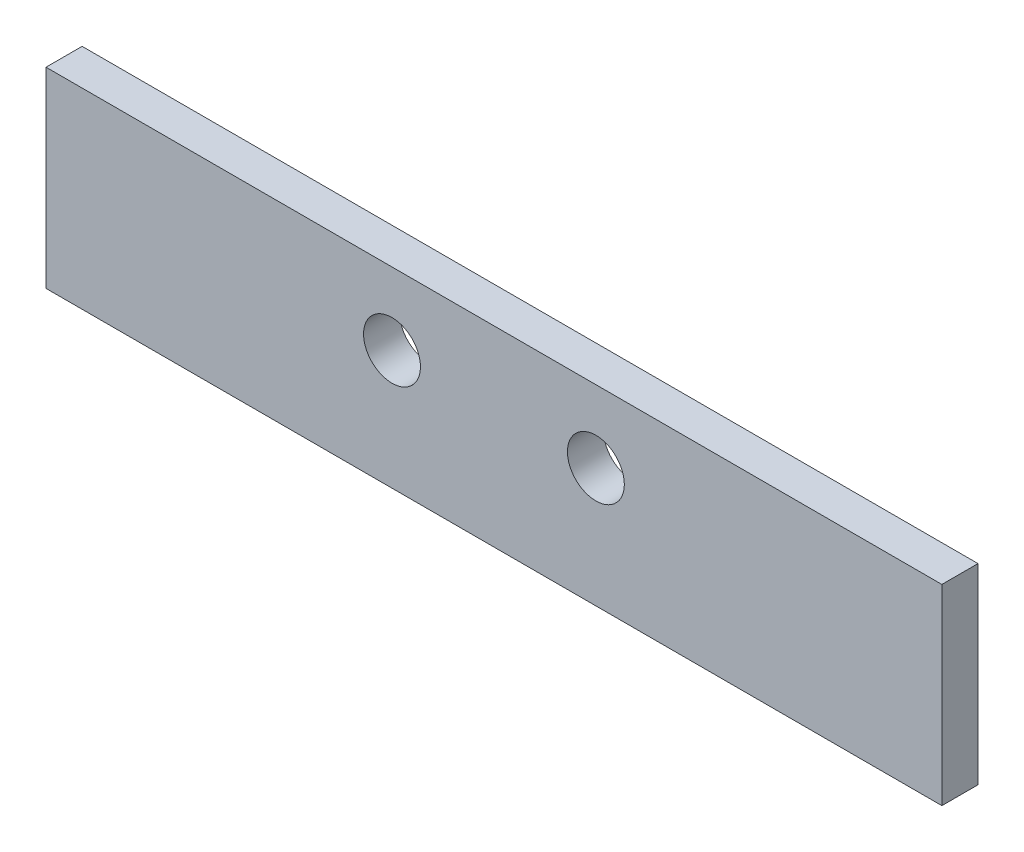
ISO-10303-21;
HEADER;
FILE_DESCRIPTION(('STEP AP214'),'2;1');
FILE_NAME('part.step','',(''),(''),'','','');
FILE_SCHEMA(('AUTOMOTIVE_DESIGN { 1 0 10303 214 1 1 1 1 }'));
ENDSEC;
DATA;
#1=APPLICATION_CONTEXT('core data for automotive mechanical design processes');
#2=APPLICATION_PROTOCOL_DEFINITION('international standard','automotive_design',2000,#1);
#3=PRODUCT_CONTEXT('',#1,'mechanical');
#4=PRODUCT('Part','Part','',(#3));
#5=PRODUCT_RELATED_PRODUCT_CATEGORY('part','',(#4));
#6=PRODUCT_DEFINITION_FORMATION('','',#4);
#7=PRODUCT_DEFINITION_CONTEXT('part definition',#1,'design');
#8=PRODUCT_DEFINITION('design','',#6,#7);
#9=PRODUCT_DEFINITION_SHAPE('','',#8);
#10=(LENGTH_UNIT() NAMED_UNIT(*) SI_UNIT(.MILLI.,.METRE.));
#11=(NAMED_UNIT(*) PLANE_ANGLE_UNIT() SI_UNIT($,.RADIAN.));
#12=(NAMED_UNIT(*) SI_UNIT($,.STERADIAN.) SOLID_ANGLE_UNIT());
#13=UNCERTAINTY_MEASURE_WITH_UNIT(LENGTH_MEASURE(1.E-05),#10,'distance_accuracy_value','');
#14=(GEOMETRIC_REPRESENTATION_CONTEXT(3) GLOBAL_UNCERTAINTY_ASSIGNED_CONTEXT((#13)) GLOBAL_UNIT_ASSIGNED_CONTEXT((#10,
#11,#12)) REPRESENTATION_CONTEXT('',''));
#15=CARTESIAN_POINT('',(0.,0.,0.));
#16=DIRECTION('',(0.,0.,1.));
#17=DIRECTION('',(1.,0.,0.));
#18=AXIS2_PLACEMENT_3D('',#15,#16,#17);
#19=CARTESIAN_POINT('',(39.37,-8.4201,3.175));
#20=DIRECTION('',(-1.,0.,0.));
#21=DIRECTION('',(0.,0.,1.));
#22=AXIS2_PLACEMENT_3D('',#19,#20,#21);
#23=PLANE('',#22);
#24=DIRECTION('',(0.,1.,0.));
#25=VECTOR('',#24,1.);
#26=CARTESIAN_POINT('',(39.37,-8.4201,0.));
#27=LINE('',#26,#25);
#28=CARTESIAN_POINT('',(39.37,-8.4201,0.));
#29=VERTEX_POINT('',#28);
#30=CARTESIAN_POINT('',(39.37,8.4201,0.));
#31=VERTEX_POINT('',#30);
#32=EDGE_CURVE('E104',#29,#31,#27,.T.);
#33=ORIENTED_EDGE('',*,*,#32,.T.);
#34=DIRECTION('',(0.,0.,-1.));
#35=VECTOR('',#34,1.);
#36=CARTESIAN_POINT('',(39.37,8.4201,3.175));
#37=LINE('',#36,#35);
#38=CARTESIAN_POINT('',(39.37,8.4201,3.175));
#39=VERTEX_POINT('',#38);
#40=EDGE_CURVE('E11',#39,#31,#37,.T.);
#41=ORIENTED_EDGE('',*,*,#40,.F.);
#42=DIRECTION('',(0.,1.,0.));
#43=VECTOR('',#42,1.);
#44=CARTESIAN_POINT('',(39.37,-8.4201,3.175));
#45=LINE('',#44,#43);
#46=CARTESIAN_POINT('',(39.37,-8.4201,3.175));
#47=VERTEX_POINT('',#46);
#48=EDGE_CURVE('E92',#47,#39,#45,.T.);
#49=ORIENTED_EDGE('',*,*,#48,.F.);
#50=DIRECTION('',(0.,0.,-1.));
#51=VECTOR('',#50,1.);
#52=CARTESIAN_POINT('',(39.37,-8.4201,3.175));
#53=LINE('',#52,#51);
#54=EDGE_CURVE('E100',#47,#29,#53,.T.);
#55=ORIENTED_EDGE('',*,*,#54,.T.);
#56=EDGE_LOOP('',(#33,#41,#49,#55));
#57=FACE_BOUND('',#56,.T.);
#58=ADVANCED_FACE('F41',(#57),#23,.F.);
#59=CARTESIAN_POINT('',(-39.37,8.4201,3.175));
#60=DIRECTION('',(0.,-1.,0.));
#61=DIRECTION('',(0.,0.,-1.));
#62=AXIS2_PLACEMENT_3D('',#59,#60,#61);
#63=PLANE('',#62);
#64=DIRECTION('',(-1.,0.,0.));
#65=VECTOR('',#64,1.);
#66=CARTESIAN_POINT('',(-39.37,8.4201,0.));
#67=LINE('',#66,#65);
#68=CARTESIAN_POINT('',(-39.37,8.4201,0.));
#69=VERTEX_POINT('',#68);
#70=EDGE_CURVE('E96',#31,#69,#67,.T.);
#71=ORIENTED_EDGE('',*,*,#70,.T.);
#72=DIRECTION('',(0.,0.,-1.));
#73=VECTOR('',#72,1.);
#74=CARTESIAN_POINT('',(-39.37,8.4201,3.175));
#75=LINE('',#74,#73);
#76=CARTESIAN_POINT('',(-39.37,8.4201,3.175));
#77=VERTEX_POINT('',#76);
#78=EDGE_CURVE('E49',#77,#69,#75,.T.);
#79=ORIENTED_EDGE('',*,*,#78,.F.);
#80=DIRECTION('',(-1.,0.,0.));
#81=VECTOR('',#80,1.);
#82=CARTESIAN_POINT('',(-39.37,8.4201,3.175));
#83=LINE('',#82,#81);
#84=EDGE_CURVE('E87',#39,#77,#83,.T.);
#85=ORIENTED_EDGE('',*,*,#84,.F.);
#86=ORIENTED_EDGE('',*,*,#40,.T.);
#87=EDGE_LOOP('',(#71,#79,#85,#86));
#88=FACE_BOUND('',#87,.T.);
#89=ADVANCED_FACE('F95',(#88),#63,.F.);
#90=CARTESIAN_POINT('',(-39.37,-8.4201,3.175));
#91=DIRECTION('',(1.,0.,0.));
#92=DIRECTION('',(0.,0.,-1.));
#93=AXIS2_PLACEMENT_3D('',#90,#91,#92);
#94=PLANE('',#93);
#95=DIRECTION('',(0.,-1.,0.));
#96=VECTOR('',#95,1.);
#97=CARTESIAN_POINT('',(-39.37,-8.4201,0.));
#98=LINE('',#97,#96);
#99=CARTESIAN_POINT('',(-39.37,-8.4201,0.));
#100=VERTEX_POINT('',#99);
#101=EDGE_CURVE('E74',#69,#100,#98,.T.);
#102=ORIENTED_EDGE('',*,*,#101,.T.);
#103=DIRECTION('',(0.,0.,-1.));
#104=VECTOR('',#103,1.);
#105=CARTESIAN_POINT('',(-39.37,-8.4201,3.175));
#106=LINE('',#105,#104);
#107=CARTESIAN_POINT('',(-39.37,-8.4201,3.175));
#108=VERTEX_POINT('',#107);
#109=EDGE_CURVE('E97',#108,#100,#106,.T.);
#110=ORIENTED_EDGE('',*,*,#109,.F.);
#111=DIRECTION('',(0.,-1.,0.));
#112=VECTOR('',#111,1.);
#113=CARTESIAN_POINT('',(-39.37,-8.4201,3.175));
#114=LINE('',#113,#112);
#115=EDGE_CURVE('E90',#77,#108,#114,.T.);
#116=ORIENTED_EDGE('',*,*,#115,.F.);
#117=ORIENTED_EDGE('',*,*,#78,.T.);
#118=EDGE_LOOP('',(#102,#110,#116,#117));
#119=FACE_BOUND('',#118,.T.);
#120=ADVANCED_FACE('F98',(#119),#94,.F.);
#121=CARTESIAN_POINT('',(-39.37,-8.4201,3.175));
#122=DIRECTION('',(0.,1.,0.));
#123=DIRECTION('',(0.,0.,1.));
#124=AXIS2_PLACEMENT_3D('',#121,#122,#123);
#125=PLANE('',#124);
#126=DIRECTION('',(1.,0.,0.));
#127=VECTOR('',#126,1.);
#128=CARTESIAN_POINT('',(-39.37,-8.4201,0.));
#129=LINE('',#128,#127);
#130=EDGE_CURVE('E80',#100,#29,#129,.T.);
#131=ORIENTED_EDGE('',*,*,#130,.T.);
#132=ORIENTED_EDGE('',*,*,#54,.F.);
#133=DIRECTION('',(1.,0.,0.));
#134=VECTOR('',#133,1.);
#135=CARTESIAN_POINT('',(-39.37,-8.4201,3.175));
#136=LINE('',#135,#134);
#137=EDGE_CURVE('E57',#108,#47,#136,.T.);
#138=ORIENTED_EDGE('',*,*,#137,.F.);
#139=ORIENTED_EDGE('',*,*,#109,.T.);
#140=EDGE_LOOP('',(#131,#132,#138,#139));
#141=FACE_BOUND('',#140,.T.);
#142=ADVANCED_FACE('F112',(#141),#125,.F.);
#143=CARTESIAN_POINT('',(0.,0.,3.175));
#144=DIRECTION('',(0.,0.,-1.));
#145=DIRECTION('',(-1.,0.,0.));
#146=AXIS2_PLACEMENT_3D('',#143,#144,#145);
#147=PLANE('',#146);
#148=CARTESIAN_POINT('',(-8.95985,2.0701,3.175));
#149=DIRECTION('',(0.,0.,1.));
#150=DIRECTION('',(1.,0.,0.));
#151=AXIS2_PLACEMENT_3D('',#148,#149,#150);
#152=CIRCLE('',#151,2.5);
#153=CARTESIAN_POINT('',(-6.45985,2.0701,3.175));
#154=VERTEX_POINT('',#153);
#155=EDGE_CURVE('E124',#154,#154,#152,.T.);
#156=ORIENTED_EDGE('',*,*,#155,.F.);
#157=EDGE_LOOP('',(#156));
#158=FACE_BOUND('',#157,.T.);
#159=CARTESIAN_POINT('',(8.95985,2.0701,3.175));
#160=DIRECTION('',(0.,0.,1.));
#161=DIRECTION('',(1.,0.,0.));
#162=AXIS2_PLACEMENT_3D('',#159,#160,#161);
#163=CIRCLE('',#162,2.5);
#164=CARTESIAN_POINT('',(11.45985,2.0701,3.175));
#165=VERTEX_POINT('',#164);
#166=EDGE_CURVE('E121',#165,#165,#163,.T.);
#167=ORIENTED_EDGE('',*,*,#166,.F.);
#168=EDGE_LOOP('',(#167));
#169=FACE_BOUND('',#168,.T.);
#170=ORIENTED_EDGE('',*,*,#48,.T.);
#171=ORIENTED_EDGE('',*,*,#84,.T.);
#172=ORIENTED_EDGE('',*,*,#115,.T.);
#173=ORIENTED_EDGE('',*,*,#137,.T.);
#174=EDGE_LOOP('',(#170,#171,#172,#173));
#175=FACE_BOUND('',#174,.T.);
#176=ADVANCED_FACE('F88',(#158,#169,#175),#147,.F.);
#177=CARTESIAN_POINT('',(0.,0.,0.));
#178=DIRECTION('',(0.,0.,-1.));
#179=DIRECTION('',(-1.,0.,0.));
#180=AXIS2_PLACEMENT_3D('',#177,#178,#179);
#181=PLANE('',#180);
#182=CARTESIAN_POINT('',(-8.95985,2.0701,0.));
#183=DIRECTION('',(0.,0.,1.));
#184=DIRECTION('',(1.,0.,0.));
#185=AXIS2_PLACEMENT_3D('',#182,#183,#184);
#186=CIRCLE('',#185,2.5);
#187=CARTESIAN_POINT('',(-6.45985,2.0701,0.));
#188=VERTEX_POINT('',#187);
#189=EDGE_CURVE('E107',#188,#188,#186,.T.);
#190=ORIENTED_EDGE('',*,*,#189,.T.);
#191=EDGE_LOOP('',(#190));
#192=FACE_BOUND('',#191,.T.);
#193=CARTESIAN_POINT('',(8.95985,2.0701,0.));
#194=DIRECTION('',(0.,0.,1.));
#195=DIRECTION('',(1.,0.,0.));
#196=AXIS2_PLACEMENT_3D('',#193,#194,#195);
#197=CIRCLE('',#196,2.5);
#198=CARTESIAN_POINT('',(11.45985,2.0701,0.));
#199=VERTEX_POINT('',#198);
#200=EDGE_CURVE('E118',#199,#199,#197,.T.);
#201=ORIENTED_EDGE('',*,*,#200,.T.);
#202=EDGE_LOOP('',(#201));
#203=FACE_BOUND('',#202,.T.);
#204=ORIENTED_EDGE('',*,*,#32,.F.);
#205=ORIENTED_EDGE('',*,*,#130,.F.);
#206=ORIENTED_EDGE('',*,*,#101,.F.);
#207=ORIENTED_EDGE('',*,*,#70,.F.);
#208=EDGE_LOOP('',(#204,#205,#206,#207));
#209=FACE_BOUND('',#208,.T.);
#210=ADVANCED_FACE('F115',(#192,#203,#209),#181,.T.);
#211=CARTESIAN_POINT('',(8.95985,2.0701,0.));
#212=DIRECTION('',(0.,0.,1.));
#213=DIRECTION('',(1.,0.,0.));
#214=AXIS2_PLACEMENT_3D('',#211,#212,#213);
#215=CYLINDRICAL_SURFACE('',#214,2.5);
#216=ORIENTED_EDGE('',*,*,#200,.F.);
#217=EDGE_LOOP('',(#216));
#218=FACE_BOUND('',#217,.T.);
#219=ORIENTED_EDGE('',*,*,#166,.T.);
#220=EDGE_LOOP('',(#219));
#221=FACE_BOUND('',#220,.T.);
#222=ADVANCED_FACE('F135',(#218,#221),#215,.F.);
#223=CARTESIAN_POINT('',(-8.95985,2.0701,0.));
#224=DIRECTION('',(0.,0.,1.));
#225=DIRECTION('',(1.,0.,0.));
#226=AXIS2_PLACEMENT_3D('',#223,#224,#225);
#227=CYLINDRICAL_SURFACE('',#226,2.5);
#228=ORIENTED_EDGE('',*,*,#189,.F.);
#229=EDGE_LOOP('',(#228));
#230=FACE_BOUND('',#229,.T.);
#231=ORIENTED_EDGE('',*,*,#155,.T.);
#232=EDGE_LOOP('',(#231));
#233=FACE_BOUND('',#232,.T.);
#234=ADVANCED_FACE('F132',(#230,#233),#227,.F.);
#235=CLOSED_SHELL('',(#58,#89,#120,#142,#176,#210,#222,#234));
#236=MANIFOLD_SOLID_BREP('B2',#235);
#237=ADVANCED_BREP_SHAPE_REPRESENTATION('',(#18,#236),#14);
#238=SHAPE_DEFINITION_REPRESENTATION(#9,#237);
ENDSEC;
END-ISO-10303-21;
